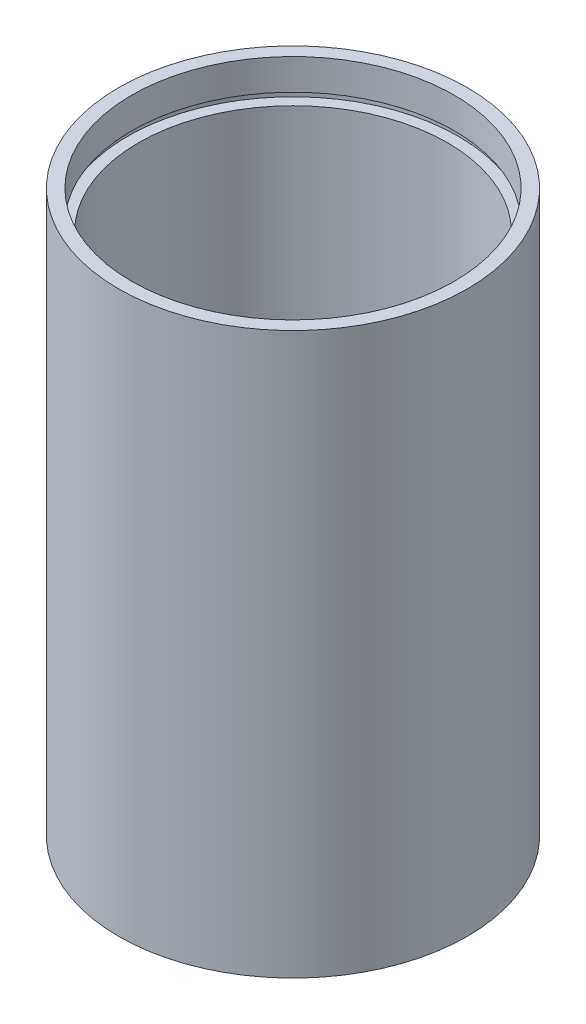
ISO-10303-21;
HEADER;
FILE_DESCRIPTION(('STEP AP214'),'2;1');
FILE_NAME('part.step','',(''),(''),'','','');
FILE_SCHEMA(('AUTOMOTIVE_DESIGN { 1 0 10303 214 1 1 1 1 }'));
ENDSEC;
DATA;
#1=APPLICATION_CONTEXT('core data for automotive mechanical design processes');
#2=APPLICATION_PROTOCOL_DEFINITION('international standard','automotive_design',2000,#1);
#3=PRODUCT_CONTEXT('',#1,'mechanical');
#4=PRODUCT('Part','Part','',(#3));
#5=PRODUCT_RELATED_PRODUCT_CATEGORY('part','',(#4));
#6=PRODUCT_DEFINITION_FORMATION('','',#4);
#7=PRODUCT_DEFINITION_CONTEXT('part definition',#1,'design');
#8=PRODUCT_DEFINITION('design','',#6,#7);
#9=PRODUCT_DEFINITION_SHAPE('','',#8);
#10=(LENGTH_UNIT() NAMED_UNIT(*) SI_UNIT(.MILLI.,.METRE.));
#11=(NAMED_UNIT(*) PLANE_ANGLE_UNIT() SI_UNIT($,.RADIAN.));
#12=(NAMED_UNIT(*) SI_UNIT($,.STERADIAN.) SOLID_ANGLE_UNIT());
#13=UNCERTAINTY_MEASURE_WITH_UNIT(LENGTH_MEASURE(1.E-05),#10,'distance_accuracy_value','');
#14=(GEOMETRIC_REPRESENTATION_CONTEXT(3) GLOBAL_UNCERTAINTY_ASSIGNED_CONTEXT((#13)) GLOBAL_UNIT_ASSIGNED_CONTEXT((#10,
#11,#12)) REPRESENTATION_CONTEXT('',''));
#15=CARTESIAN_POINT('',(0.,0.,0.));
#16=DIRECTION('',(0.,0.,1.));
#17=DIRECTION('',(1.,0.,0.));
#18=AXIS2_PLACEMENT_3D('',#15,#16,#17);
#19=CARTESIAN_POINT('',(23.5,0.,0.));
#20=DIRECTION('',(0.,1.,0.));
#21=DIRECTION('',(0.,0.,1.));
#22=AXIS2_PLACEMENT_3D('',#19,#20,#21);
#23=PLANE('',#22);
#24=CARTESIAN_POINT('',(0.,0.,0.));
#25=DIRECTION('',(0.,1.,0.));
#26=DIRECTION('',(0.,0.,1.));
#27=AXIS2_PLACEMENT_3D('',#24,#25,#26);
#28=CIRCLE('',#27,25.4);
#29=CARTESIAN_POINT('',(0.,0.,25.4));
#30=VERTEX_POINT('',#29);
#31=EDGE_CURVE('E10',#30,#30,#28,.T.);
#32=ORIENTED_EDGE('',*,*,#31,.F.);
#33=EDGE_LOOP('',(#32));
#34=FACE_BOUND('',#33,.T.);
#35=CARTESIAN_POINT('',(0.,0.,0.));
#36=DIRECTION('',(0.,1.,0.));
#37=DIRECTION('',(0.,0.,1.));
#38=AXIS2_PLACEMENT_3D('',#35,#36,#37);
#39=CIRCLE('',#38,23.5);
#40=CARTESIAN_POINT('',(0.,0.,23.5));
#41=VERTEX_POINT('',#40);
#42=EDGE_CURVE('E77',#41,#41,#39,.T.);
#43=ORIENTED_EDGE('',*,*,#42,.T.);
#44=EDGE_LOOP('',(#43));
#45=FACE_BOUND('',#44,.T.);
#46=ADVANCED_FACE('F37',(#34,#45),#23,.F.);
#47=CARTESIAN_POINT('',(0.,161.376166943427,0.));
#48=DIRECTION('',(0.,1.,0.));
#49=DIRECTION('',(0.,0.,1.));
#50=AXIS2_PLACEMENT_3D('',#47,#48,#49);
#51=CYLINDRICAL_SURFACE('',#50,25.4);
#52=CARTESIAN_POINT('',(0.,81.7,0.));
#53=DIRECTION('',(0.,1.,0.));
#54=DIRECTION('',(0.,0.,1.));
#55=AXIS2_PLACEMENT_3D('',#52,#53,#54);
#56=CIRCLE('',#55,25.4);
#57=CARTESIAN_POINT('',(0.,81.7,25.4));
#58=VERTEX_POINT('',#57);
#59=EDGE_CURVE('E43',#58,#58,#56,.T.);
#60=ORIENTED_EDGE('',*,*,#59,.F.);
#61=EDGE_LOOP('',(#60));
#62=FACE_BOUND('',#61,.T.);
#63=ORIENTED_EDGE('',*,*,#31,.T.);
#64=EDGE_LOOP('',(#63));
#65=FACE_BOUND('',#64,.T.);
#66=ADVANCED_FACE('F138',(#62,#65),#51,.T.);
#67=CARTESIAN_POINT('',(23.5,81.7,0.));
#68=DIRECTION('',(0.,-1.,0.));
#69=DIRECTION('',(0.,0.,-1.));
#70=AXIS2_PLACEMENT_3D('',#67,#68,#69);
#71=PLANE('',#70);
#72=CARTESIAN_POINT('',(0.,81.7,0.));
#73=DIRECTION('',(0.,1.,0.));
#74=DIRECTION('',(0.,0.,1.));
#75=AXIS2_PLACEMENT_3D('',#72,#73,#74);
#76=CIRCLE('',#75,23.5);
#77=CARTESIAN_POINT('',(0.,81.7,23.5));
#78=VERTEX_POINT('',#77);
#79=EDGE_CURVE('E47',#78,#78,#76,.T.);
#80=ORIENTED_EDGE('',*,*,#79,.F.);
#81=EDGE_LOOP('',(#80));
#82=FACE_BOUND('',#81,.T.);
#83=ORIENTED_EDGE('',*,*,#59,.T.);
#84=EDGE_LOOP('',(#83));
#85=FACE_BOUND('',#84,.T.);
#86=ADVANCED_FACE('F133',(#82,#85),#71,.F.);
#87=CARTESIAN_POINT('',(0.,161.376166943427,0.));
#88=DIRECTION('',(0.,1.,0.));
#89=DIRECTION('',(0.,0.,1.));
#90=AXIS2_PLACEMENT_3D('',#87,#88,#89);
#91=CYLINDRICAL_SURFACE('',#90,23.5);
#92=CARTESIAN_POINT('',(0.,77.2,0.));
#93=DIRECTION('',(0.,1.,0.));
#94=DIRECTION('',(0.,0.,1.));
#95=AXIS2_PLACEMENT_3D('',#92,#93,#94);
#96=CIRCLE('',#95,23.5);
#97=CARTESIAN_POINT('',(0.,77.2,23.5));
#98=VERTEX_POINT('',#97);
#99=EDGE_CURVE('E51',#98,#98,#96,.T.);
#100=ORIENTED_EDGE('',*,*,#99,.F.);
#101=EDGE_LOOP('',(#100));
#102=FACE_BOUND('',#101,.T.);
#103=ORIENTED_EDGE('',*,*,#79,.T.);
#104=EDGE_LOOP('',(#103));
#105=FACE_BOUND('',#104,.T.);
#106=ADVANCED_FACE('F127',(#102,#105),#91,.F.);
#107=CARTESIAN_POINT('',(24.1,77.2,0.));
#108=DIRECTION('',(0.,1.,0.));
#109=DIRECTION('',(0.,0.,1.));
#110=AXIS2_PLACEMENT_3D('',#107,#108,#109);
#111=PLANE('',#110);
#112=CARTESIAN_POINT('',(0.,77.2,0.));
#113=DIRECTION('',(0.,1.,0.));
#114=DIRECTION('',(0.,0.,1.));
#115=AXIS2_PLACEMENT_3D('',#112,#113,#114);
#116=CIRCLE('',#115,24.1);
#117=CARTESIAN_POINT('',(0.,77.2,24.1));
#118=VERTEX_POINT('',#117);
#119=EDGE_CURVE('E56',#118,#118,#116,.T.);
#120=ORIENTED_EDGE('',*,*,#119,.F.);
#121=EDGE_LOOP('',(#120));
#122=FACE_BOUND('',#121,.T.);
#123=ORIENTED_EDGE('',*,*,#99,.T.);
#124=EDGE_LOOP('',(#123));
#125=FACE_BOUND('',#124,.T.);
#126=ADVANCED_FACE('F121',(#122,#125),#111,.F.);
#127=CARTESIAN_POINT('',(0.,161.376166943427,0.));
#128=DIRECTION('',(0.,1.,0.));
#129=DIRECTION('',(0.,0.,1.));
#130=AXIS2_PLACEMENT_3D('',#127,#128,#129);
#131=CYLINDRICAL_SURFACE('',#130,24.1);
#132=CARTESIAN_POINT('',(0.,76.2,0.));
#133=DIRECTION('',(0.,1.,0.));
#134=DIRECTION('',(0.,0.,1.));
#135=AXIS2_PLACEMENT_3D('',#132,#133,#134);
#136=CIRCLE('',#135,24.1);
#137=CARTESIAN_POINT('',(0.,76.2,24.1));
#138=VERTEX_POINT('',#137);
#139=EDGE_CURVE('E59',#138,#138,#136,.T.);
#140=ORIENTED_EDGE('',*,*,#139,.F.);
#141=EDGE_LOOP('',(#140));
#142=FACE_BOUND('',#141,.T.);
#143=ORIENTED_EDGE('',*,*,#119,.T.);
#144=EDGE_LOOP('',(#143));
#145=FACE_BOUND('',#144,.T.);
#146=ADVANCED_FACE('F115',(#142,#145),#131,.F.);
#147=CARTESIAN_POINT('',(22.5,76.2,0.));
#148=DIRECTION('',(0.,-1.,0.));
#149=DIRECTION('',(0.,0.,-1.));
#150=AXIS2_PLACEMENT_3D('',#147,#148,#149);
#151=PLANE('',#150);
#152=CARTESIAN_POINT('',(0.,76.2,0.));
#153=DIRECTION('',(0.,1.,0.));
#154=DIRECTION('',(0.,0.,1.));
#155=AXIS2_PLACEMENT_3D('',#152,#153,#154);
#156=CIRCLE('',#155,22.5);
#157=CARTESIAN_POINT('',(0.,76.2,22.5));
#158=VERTEX_POINT('',#157);
#159=EDGE_CURVE('E62',#158,#158,#156,.T.);
#160=ORIENTED_EDGE('',*,*,#159,.F.);
#161=EDGE_LOOP('',(#160));
#162=FACE_BOUND('',#161,.T.);
#163=ORIENTED_EDGE('',*,*,#139,.T.);
#164=EDGE_LOOP('',(#163));
#165=FACE_BOUND('',#164,.T.);
#166=ADVANCED_FACE('F109',(#162,#165),#151,.F.);
#167=CARTESIAN_POINT('',(0.,161.376166943427,0.));
#168=DIRECTION('',(0.,1.,0.));
#169=DIRECTION('',(0.,0.,1.));
#170=AXIS2_PLACEMENT_3D('',#167,#168,#169);
#171=CYLINDRICAL_SURFACE('',#170,22.5);
#172=CARTESIAN_POINT('',(0.,5.49999999999998,0.));
#173=DIRECTION('',(0.,1.,0.));
#174=DIRECTION('',(0.,0.,1.));
#175=AXIS2_PLACEMENT_3D('',#172,#173,#174);
#176=CIRCLE('',#175,22.5);
#177=CARTESIAN_POINT('',(0.,5.49999999999998,22.5));
#178=VERTEX_POINT('',#177);
#179=EDGE_CURVE('E65',#178,#178,#176,.T.);
#180=ORIENTED_EDGE('',*,*,#179,.F.);
#181=EDGE_LOOP('',(#180));
#182=FACE_BOUND('',#181,.T.);
#183=ORIENTED_EDGE('',*,*,#159,.T.);
#184=EDGE_LOOP('',(#183));
#185=FACE_BOUND('',#184,.T.);
#186=ADVANCED_FACE('F103',(#182,#185),#171,.F.);
#187=CARTESIAN_POINT('',(22.5,5.49999999999998,0.));
#188=DIRECTION('',(0.,1.,0.));
#189=DIRECTION('',(0.,0.,1.));
#190=AXIS2_PLACEMENT_3D('',#187,#188,#189);
#191=PLANE('',#190);
#192=CARTESIAN_POINT('',(0.,5.49999999999998,0.));
#193=DIRECTION('',(0.,1.,0.));
#194=DIRECTION('',(0.,0.,1.));
#195=AXIS2_PLACEMENT_3D('',#192,#193,#194);
#196=CIRCLE('',#195,24.1);
#197=CARTESIAN_POINT('',(0.,5.49999999999998,24.1));
#198=VERTEX_POINT('',#197);
#199=EDGE_CURVE('E68',#198,#198,#196,.T.);
#200=ORIENTED_EDGE('',*,*,#199,.F.);
#201=EDGE_LOOP('',(#200));
#202=FACE_BOUND('',#201,.T.);
#203=ORIENTED_EDGE('',*,*,#179,.T.);
#204=EDGE_LOOP('',(#203));
#205=FACE_BOUND('',#204,.T.);
#206=ADVANCED_FACE('F97',(#202,#205),#191,.F.);
#207=CARTESIAN_POINT('',(0.,161.376166943427,0.));
#208=DIRECTION('',(0.,1.,0.));
#209=DIRECTION('',(0.,0.,1.));
#210=AXIS2_PLACEMENT_3D('',#207,#208,#209);
#211=CYLINDRICAL_SURFACE('',#210,24.1);
#212=CARTESIAN_POINT('',(0.,4.49999999999998,0.));
#213=DIRECTION('',(0.,1.,0.));
#214=DIRECTION('',(0.,0.,1.));
#215=AXIS2_PLACEMENT_3D('',#212,#213,#214);
#216=CIRCLE('',#215,24.1);
#217=CARTESIAN_POINT('',(0.,4.49999999999998,24.1));
#218=VERTEX_POINT('',#217);
#219=EDGE_CURVE('E71',#218,#218,#216,.T.);
#220=ORIENTED_EDGE('',*,*,#219,.F.);
#221=EDGE_LOOP('',(#220));
#222=FACE_BOUND('',#221,.T.);
#223=ORIENTED_EDGE('',*,*,#199,.T.);
#224=EDGE_LOOP('',(#223));
#225=FACE_BOUND('',#224,.T.);
#226=ADVANCED_FACE('F91',(#222,#225),#211,.F.);
#227=CARTESIAN_POINT('',(23.5,4.49999999999998,0.));
#228=DIRECTION('',(0.,-1.,0.));
#229=DIRECTION('',(0.,0.,-1.));
#230=AXIS2_PLACEMENT_3D('',#227,#228,#229);
#231=PLANE('',#230);
#232=CARTESIAN_POINT('',(0.,4.49999999999998,0.));
#233=DIRECTION('',(0.,1.,0.));
#234=DIRECTION('',(0.,0.,1.));
#235=AXIS2_PLACEMENT_3D('',#232,#233,#234);
#236=CIRCLE('',#235,23.5);
#237=CARTESIAN_POINT('',(0.,4.49999999999998,23.5));
#238=VERTEX_POINT('',#237);
#239=EDGE_CURVE('E74',#238,#238,#236,.T.);
#240=ORIENTED_EDGE('',*,*,#239,.F.);
#241=EDGE_LOOP('',(#240));
#242=FACE_BOUND('',#241,.T.);
#243=ORIENTED_EDGE('',*,*,#219,.T.);
#244=EDGE_LOOP('',(#243));
#245=FACE_BOUND('',#244,.T.);
#246=ADVANCED_FACE('F85',(#242,#245),#231,.F.);
#247=CARTESIAN_POINT('',(0.,161.376166943427,0.));
#248=DIRECTION('',(0.,1.,0.));
#249=DIRECTION('',(0.,0.,1.));
#250=AXIS2_PLACEMENT_3D('',#247,#248,#249);
#251=CYLINDRICAL_SURFACE('',#250,23.5);
#252=ORIENTED_EDGE('',*,*,#42,.F.);
#253=EDGE_LOOP('',(#252));
#254=FACE_BOUND('',#253,.T.);
#255=ORIENTED_EDGE('',*,*,#239,.T.);
#256=EDGE_LOOP('',(#255));
#257=FACE_BOUND('',#256,.T.);
#258=ADVANCED_FACE('F82',(#254,#257),#251,.F.);
#259=CLOSED_SHELL('',(#46,#66,#86,#106,#126,#146,#166,#186,#206,#226,#246,#258));
#260=MANIFOLD_SOLID_BREP('B2',#259);
#261=ADVANCED_BREP_SHAPE_REPRESENTATION('',(#18,#260),#14);
#262=SHAPE_DEFINITION_REPRESENTATION(#9,#261);
ENDSEC;
END-ISO-10303-21;
